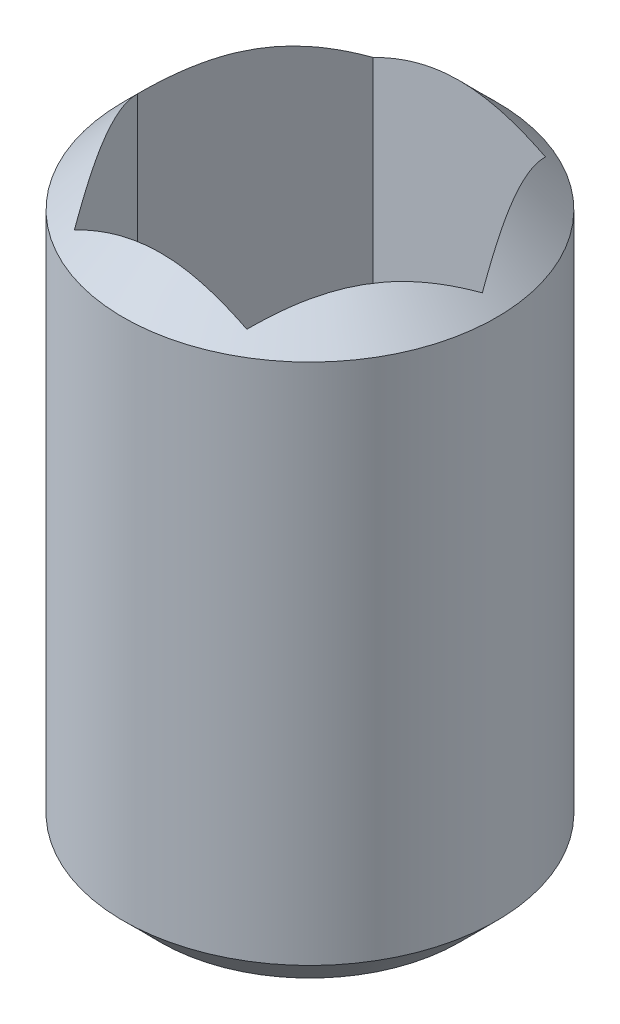
ISO-10303-21;
HEADER;
FILE_DESCRIPTION(('STEP AP214'),'2;1');
FILE_NAME('part.step','',(''),(''),'','','');
FILE_SCHEMA(('AUTOMOTIVE_DESIGN { 1 0 10303 214 1 1 1 1 }'));
ENDSEC;
DATA;
#1=APPLICATION_CONTEXT('core data for automotive mechanical design processes');
#2=APPLICATION_PROTOCOL_DEFINITION('international standard','automotive_design',2000,#1);
#3=PRODUCT_CONTEXT('',#1,'mechanical');
#4=PRODUCT('Part','Part','',(#3));
#5=PRODUCT_RELATED_PRODUCT_CATEGORY('part','',(#4));
#6=PRODUCT_DEFINITION_FORMATION('','',#4);
#7=PRODUCT_DEFINITION_CONTEXT('part definition',#1,'design');
#8=PRODUCT_DEFINITION('design','',#6,#7);
#9=PRODUCT_DEFINITION_SHAPE('','',#8);
#10=(LENGTH_UNIT() NAMED_UNIT(*) SI_UNIT(.MILLI.,.METRE.));
#11=(NAMED_UNIT(*) PLANE_ANGLE_UNIT() SI_UNIT($,.RADIAN.));
#12=(NAMED_UNIT(*) SI_UNIT($,.STERADIAN.) SOLID_ANGLE_UNIT());
#13=UNCERTAINTY_MEASURE_WITH_UNIT(LENGTH_MEASURE(1.E-05),#10,'distance_accuracy_value','');
#14=(GEOMETRIC_REPRESENTATION_CONTEXT(3) GLOBAL_UNCERTAINTY_ASSIGNED_CONTEXT((#13)) GLOBAL_UNIT_ASSIGNED_CONTEXT((#10,
#11,#12)) REPRESENTATION_CONTEXT('',''));
#15=CARTESIAN_POINT('',(0.,0.,0.));
#16=DIRECTION('',(0.,0.,1.));
#17=DIRECTION('',(1.,0.,0.));
#18=AXIS2_PLACEMENT_3D('',#15,#16,#17);
#19=CARTESIAN_POINT('',(3.20604090851,-4.9652643177,179.13));
#20=DIRECTION('',(0.866025403784329,0.,-0.50000000000019));
#21=DIRECTION('',(-0.50000000000019,0.,-0.866025403784329));
#22=AXIS2_PLACEMENT_3D('',#19,#20,#21);
#23=PLANE('',#22);
#24=DIRECTION('',(0.,1.,0.));
#25=VECTOR('',#24,1.);
#26=CARTESIAN_POINT('',(2.628690639321,-4.9652643177,178.13));
#27=LINE('',#26,#25);
#28=CARTESIAN_POINT('',(2.62869063931867,-5.11996485606075,178.129999999997));
#29=VERTEX_POINT('',#28);
#30=CARTESIAN_POINT('',(2.62869063932077,-6.9652643177,178.13));
#31=VERTEX_POINT('',#30);
#32=EDGE_CURVE('E131',#29,#31,#27,.F.);
#33=ORIENTED_EDGE('',*,*,#32,.F.);
#34=CARTESIAN_POINT('',(2.62869063931907,-5.11996485606431,178.129999999993));
#35=CARTESIAN_POINT('',(2.64840481556965,-5.1002690746057,178.164145954892));
#36=CARTESIAN_POINT('',(2.66844651244045,-5.0817233326066,178.198859192143));
#37=CARTESIAN_POINT('',(2.70932116488867,-5.04772861293559,178.269656166926));
#38=CARTESIAN_POINT('',(2.73015837042871,-5.03230025670447,178.305747265609));
#39=CARTESIAN_POINT('',(2.77243501243135,-5.0056588014415,178.378972557531));
#40=CARTESIAN_POINT('',(2.79387214009775,-4.99443143664018,178.416102751817));
#41=CARTESIAN_POINT('',(2.83721633360014,-4.9771464231729,178.491177097176));
#42=CARTESIAN_POINT('',(2.85912172853347,-4.97107278792963,178.529118354161));
#43=CARTESIAN_POINT('',(2.88715008342558,-4.96701549046247,178.577664888887));
#44=CARTESIAN_POINT('',(2.89319019107417,-4.9663595524137,178.588126662217));
#45=CARTESIAN_POINT('',(2.90527517498885,-4.96548388663458,178.609058468366));
#46=CARTESIAN_POINT('',(2.91132004687705,-4.965263921942,178.619528493602));
#47=CARTESIAN_POINT('',(2.93253936049439,-4.96526531090414,178.656281422888));
#48=CARTESIAN_POINT('',(2.94771833376049,-4.96665437945955,178.682572175792));
#49=CARTESIAN_POINT('',(2.97795789257979,-4.97212815747465,178.734948628066));
#50=CARTESIAN_POINT('',(2.99301838814122,-4.97621474707929,178.761034171565));
#51=CARTESIAN_POINT('',(3.03799916042888,-4.99226531814967,178.838943154531));
#52=CARTESIAN_POINT('',(3.06759162055215,-5.00801737945028,178.890198798985));
#53=CARTESIAN_POINT('',(3.11539323529342,-5.04024203951102,178.972993624401));
#54=CARTESIAN_POINT('',(3.13399181732673,-5.05457125741252,179.005207313431));
#55=CARTESIAN_POINT('',(3.17048475474073,-5.08562729588604,179.06841493515));
#56=CARTESIAN_POINT('',(3.18838399540721,-5.10233098798491,179.099417329401));
#57=CARTESIAN_POINT('',(3.20604090851394,-5.11996485606279,179.130000000007));
#58=B_SPLINE_CURVE_WITH_KNOTS('',3,(#34,#35,#36,#37,#38,#39,#40,#41,#42,#43,#44,#45,#46,#47,#48,
#49,#50,#51,#52,#53,#54,#55,#56,#57),.UNSPECIFIED.,.F.,.F.,(4,2,2,2,2,2,2,2,2,2,2,4),(0.,
0.132313199457143,0.265474890466077,0.398180194924322,0.530472334353347,0.566760915531459,
0.603029767558655,0.694057457508987,0.785148659927355,0.968083578352779,1.08759246658368,
1.20600826497133),.UNSPECIFIED.);
#59=CARTESIAN_POINT('',(3.20604090850798,-5.11996485606288,179.130000000004));
#60=VERTEX_POINT('',#59);
#61=EDGE_CURVE('E19',#29,#60,#58,.T.);
#62=ORIENTED_EDGE('',*,*,#61,.T.);
#63=DIRECTION('',(0.,1.,0.));
#64=VECTOR('',#63,1.);
#65=CARTESIAN_POINT('',(3.20604090851,-4.9652643177,179.13));
#66=LINE('',#65,#64);
#67=CARTESIAN_POINT('',(3.20604090851,-6.9652643177,179.13));
#68=VERTEX_POINT('',#67);
#69=EDGE_CURVE('E123',#68,#60,#66,.T.);
#70=ORIENTED_EDGE('',*,*,#69,.F.);
#71=DIRECTION('',(-0.50000000000019,0.,-0.866025403784329));
#72=VECTOR('',#71,1.);
#73=CARTESIAN_POINT('',(3.20604090851,-6.9652643177,179.13));
#74=LINE('',#73,#72);
#75=EDGE_CURVE('E68',#68,#31,#74,.T.);
#76=ORIENTED_EDGE('',*,*,#75,.T.);
#77=EDGE_LOOP('',(#33,#62,#70,#76));
#78=FACE_BOUND('',#77,.T.);
#79=ADVANCED_FACE('F15',(#78),#23,.T.);
#80=CARTESIAN_POINT('',(2.628690639321,-4.9652643177,178.13));
#81=DIRECTION('',(0.866025403784329,0.,0.50000000000019));
#82=DIRECTION('',(0.50000000000019,0.,-0.866025403784329));
#83=AXIS2_PLACEMENT_3D('',#80,#81,#82);
#84=PLANE('',#83);
#85=DIRECTION('',(0.,1.,0.));
#86=VECTOR('',#85,1.);
#87=CARTESIAN_POINT('',(3.20604090851,-4.9652643177,177.13));
#88=LINE('',#87,#86);
#89=CARTESIAN_POINT('',(3.20604090851243,-5.1199648560606,177.129999999997));
#90=VERTEX_POINT('',#89);
#91=CARTESIAN_POINT('',(3.20604090851023,-6.9652643177,177.13));
#92=VERTEX_POINT('',#91);
#93=EDGE_CURVE('E117',#90,#92,#88,.F.);
#94=ORIENTED_EDGE('',*,*,#93,.F.);
#95=CARTESIAN_POINT('',(3.2060409085166,-5.11996485606335,177.129999999995));
#96=CARTESIAN_POINT('',(3.18632673226315,-5.10026907460487,177.164145954892));
#97=CARTESIAN_POINT('',(3.16628503539117,-5.08172333260581,177.198859192143));
#98=CARTESIAN_POINT('',(3.12541038294209,-5.04772861293483,177.269656166926));
#99=CARTESIAN_POINT('',(3.10457317740236,-5.03230025670368,177.305747265609));
#100=CARTESIAN_POINT('',(3.06229653539993,-5.00565880144068,177.37897255753));
#101=CARTESIAN_POINT('',(3.04085940773344,-4.99443143663936,177.416102751817));
#102=CARTESIAN_POINT('',(2.99751521423097,-4.97714642317208,177.491177097176));
#103=CARTESIAN_POINT('',(2.97560981929766,-4.97107278792881,177.529118354161));
#104=CARTESIAN_POINT('',(2.94758146440556,-4.96701549046166,177.577664888886));
#105=CARTESIAN_POINT('',(2.941541356757,-4.9663595524129,177.588126662217));
#106=CARTESIAN_POINT('',(2.92945637284236,-4.96548388663378,177.609058468366));
#107=CARTESIAN_POINT('',(2.92341150095419,-4.9652639219412,177.619528493601));
#108=CARTESIAN_POINT('',(2.90219218733688,-4.96526531090335,177.656281422888));
#109=CARTESIAN_POINT('',(2.88701321407079,-4.96665437945875,177.682572175792));
#110=CARTESIAN_POINT('',(2.85677365525151,-4.97212815747385,177.734948628065));
#111=CARTESIAN_POINT('',(2.8417131596901,-4.97621474707849,177.761034171565));
#112=CARTESIAN_POINT('',(2.79673238740247,-4.99226531814885,177.83894315453));
#113=CARTESIAN_POINT('',(2.76713992727923,-5.00801737944944,177.890198798985));
#114=CARTESIAN_POINT('',(2.71933831253787,-5.04024203951024,177.972993624401));
#115=CARTESIAN_POINT('',(2.70073973050446,-5.05457125741183,178.005207313431));
#116=CARTESIAN_POINT('',(2.66424679309025,-5.08562729588557,178.06841493515));
#117=CARTESIAN_POINT('',(2.64634755242367,-5.10233098798456,178.099417329401));
#118=CARTESIAN_POINT('',(2.62869063931685,-5.11996485606256,178.130000000007));
#119=B_SPLINE_CURVE_WITH_KNOTS('',3,(#95,#96,#97,#98,#99,#100,#101,#102,#103,#104,#105,#106,
#107,#108,#109,#110,#111,#112,#113,#114,#115,#116,#117,#118),.UNSPECIFIED.,.F.,.F.,(4,2,2,2,2,2,
2,2,2,2,2,4),(0.,0.132313199457154,0.265474890466128,0.398180194924439,0.530472334353526,
0.56676091553148,0.603029767558547,0.694057457508813,0.785148659927116,0.968083578352376,
1.08759246658397,1.20600826497229),.UNSPECIFIED.);
#120=EDGE_CURVE('E60',#90,#29,#119,.T.);
#121=ORIENTED_EDGE('',*,*,#120,.T.);
#122=ORIENTED_EDGE('',*,*,#32,.T.);
#123=DIRECTION('',(0.50000000000019,0.,-0.866025403784329));
#124=VECTOR('',#123,1.);
#125=CARTESIAN_POINT('',(2.628690639321,-6.9652643177,178.13));
#126=LINE('',#125,#124);
#127=EDGE_CURVE('E77',#31,#92,#126,.T.);
#128=ORIENTED_EDGE('',*,*,#127,.T.);
#129=EDGE_LOOP('',(#94,#121,#122,#128));
#130=FACE_BOUND('',#129,.T.);
#131=ADVANCED_FACE('F183',(#130),#84,.T.);
#132=CARTESIAN_POINT('',(4.36074144689,-4.9652643177,179.13));
#133=DIRECTION('',(0.,0.,-1.));
#134=DIRECTION('',(-1.,0.,0.));
#135=AXIS2_PLACEMENT_3D('',#132,#133,#134);
#136=PLANE('',#135);
#137=ORIENTED_EDGE('',*,*,#69,.T.);
#138=CARTESIAN_POINT('',(3.2060409085025,-5.119964856064,179.129999999997));
#139=CARTESIAN_POINT('',(3.24546926100682,-5.10026907460543,179.129999999999));
#140=CARTESIAN_POINT('',(3.28555265474972,-5.08172333260633,179.13));
#141=CARTESIAN_POINT('',(3.36730195964712,-5.04772861293529,179.13));
#142=CARTESIAN_POINT('',(3.40897637072687,-5.03230025670414,179.13));
#143=CARTESIAN_POINT('',(3.49352965473196,-5.00565880144111,179.13));
#144=CARTESIAN_POINT('',(3.53640391006488,-4.99443143663977,179.13));
#145=CARTESIAN_POINT('',(3.62309229706976,-4.97714642317246,179.13));
#146=CARTESIAN_POINT('',(3.6669030869364,-4.97107278792919,179.13));
#147=CARTESIAN_POINT('',(3.72295979672066,-4.96701549046202,179.13));
#148=CARTESIAN_POINT('',(3.73504001201782,-4.96635955241325,179.13));
#149=CARTESIAN_POINT('',(3.75920997984718,-4.96548388663413,179.13));
#150=CARTESIAN_POINT('',(3.77129972362356,-4.96526392194155,179.13));
#151=CARTESIAN_POINT('',(3.81373835085822,-4.96526531090369,179.13));
#152=CARTESIAN_POINT('',(3.8440962973904,-4.96665437945909,179.13));
#153=CARTESIAN_POINT('',(3.90457541502893,-4.9721281574742,179.13));
#154=CARTESIAN_POINT('',(3.93469640615176,-4.97621474707884,179.13));
#155=CARTESIAN_POINT('',(4.02465795072701,-4.99226531814921,179.13));
#156=CARTESIAN_POINT('',(4.08384287097348,-5.00801737944981,179.13));
#157=CARTESIAN_POINT('',(4.17944610045607,-5.04024203951057,179.13));
#158=CARTESIAN_POINT('',(4.21664326452278,-5.05457125741212,179.13));
#159=CARTESIAN_POINT('',(4.28962913935097,-5.08562729588575,179.13));
#160=CARTESIAN_POINT('',(4.32542762068401,-5.10233098798468,179.13));
#161=CARTESIAN_POINT('',(4.36074144689756,-5.11996485606264,179.13));
#162=B_SPLINE_CURVE_WITH_KNOTS('',3,(#138,#139,#140,#141,#142,#143,#144,#145,#146,#147,#148,
#149,#150,#151,#152,#153,#154,#155,#156,#157,#158,#159,#160,#161),.UNSPECIFIED.,.F.,.F.,(4,2,2,
2,2,2,2,2,2,2,2,4),(0.,0.132313199457258,0.265474890466312,0.398180194924689,0.530472334353847,
0.566760915531935,0.603029767559114,0.694057457509434,0.785148659927753,0.968083578353058,
1.08759246658432,1.20600826497231),.UNSPECIFIED.);
#163=CARTESIAN_POINT('',(4.36074144689143,-5.11996485606253,179.130000000003));
#164=VERTEX_POINT('',#163);
#165=EDGE_CURVE('E120',#60,#164,#162,.T.);
#166=ORIENTED_EDGE('',*,*,#165,.T.);
#167=DIRECTION('',(0.,1.,0.));
#168=VECTOR('',#167,1.);
#169=CARTESIAN_POINT('',(4.36074144688931,-4.9652643177,179.13));
#170=LINE('',#169,#168);
#171=CARTESIAN_POINT('',(4.36074144688954,-6.9652643177,179.13));
#172=VERTEX_POINT('',#171);
#173=EDGE_CURVE('E96',#172,#164,#170,.T.);
#174=ORIENTED_EDGE('',*,*,#173,.F.);
#175=DIRECTION('',(-1.,0.,0.));
#176=VECTOR('',#175,1.);
#177=CARTESIAN_POINT('',(3.20604090851,-6.9652643177,179.13));
#178=LINE('',#177,#176);
#179=EDGE_CURVE('E81',#68,#172,#178,.F.);
#180=ORIENTED_EDGE('',*,*,#179,.F.);
#181=EDGE_LOOP('',(#137,#166,#174,#180));
#182=FACE_BOUND('',#181,.T.);
#183=ADVANCED_FACE('F170',(#182),#136,.T.);
#184=CARTESIAN_POINT('',(3.20604090851,-4.9652643177,177.13));
#185=DIRECTION('',(0.,0.,1.));
#186=DIRECTION('',(1.,0.,0.));
#187=AXIS2_PLACEMENT_3D('',#184,#185,#186);
#188=PLANE('',#187);
#189=DIRECTION('',(0.,1.,0.));
#190=VECTOR('',#189,1.);
#191=CARTESIAN_POINT('',(4.36074144689,-4.9652643177,177.13));
#192=LINE('',#191,#190);
#193=CARTESIAN_POINT('',(4.36074144689023,-5.11996485605897,177.13));
#194=VERTEX_POINT('',#193);
#195=CARTESIAN_POINT('',(4.36074144689,-6.9652643177,177.13));
#196=VERTEX_POINT('',#195);
#197=EDGE_CURVE('E106',#194,#196,#192,.F.);
#198=ORIENTED_EDGE('',*,*,#197,.F.);
#199=CARTESIAN_POINT('',(4.36074144689045,-5.11996485605908,177.13));
#200=CARTESIAN_POINT('',(4.32131309438616,-5.10026907460161,177.13));
#201=CARTESIAN_POINT('',(4.28122970064349,-5.08172333260318,177.13));
#202=CARTESIAN_POINT('',(4.19948039574674,-5.04772861293308,177.13));
#203=CARTESIAN_POINT('',(4.15780598466741,-5.03230025670218,177.13));
#204=CARTESIAN_POINT('',(4.07325270066315,-5.00565880143973,177.13));
#205=CARTESIAN_POINT('',(4.03037844533063,-4.9944314366387,177.13));
#206=CARTESIAN_POINT('',(3.9436900583266,-4.97714642317191,177.13));
#207=CARTESIAN_POINT('',(3.89987926846041,-4.97107278792884,177.13));
#208=CARTESIAN_POINT('',(3.84382255867706,-4.96701549046189,177.13));
#209=CARTESIAN_POINT('',(3.83174234338035,-4.96635955241316,177.13));
#210=CARTESIAN_POINT('',(3.8075723755519,-4.96548388663411,177.13));
#211=CARTESIAN_POINT('',(3.79548263177598,-4.96526392194155,177.13));
#212=CARTESIAN_POINT('',(3.75304400454178,-4.96526531090369,177.13));
#213=CARTESIAN_POINT('',(3.7226860580096,-4.96665437945909,177.13));
#214=CARTESIAN_POINT('',(3.66220694037107,-4.9721281574742,177.13));
#215=CARTESIAN_POINT('',(3.63208594924824,-4.97621474707884,177.13));
#216=CARTESIAN_POINT('',(3.54212440467299,-4.9922653181492,177.13));
#217=CARTESIAN_POINT('',(3.48293948442652,-5.00801737944981,177.13));
#218=CARTESIAN_POINT('',(3.38733625494391,-5.04024203951058,177.13));
#219=CARTESIAN_POINT('',(3.35013909087718,-5.05457125741213,177.13));
#220=CARTESIAN_POINT('',(3.27715321604895,-5.08562729588579,177.13));
#221=CARTESIAN_POINT('',(3.24135473471589,-5.10233098798473,177.13));
#222=CARTESIAN_POINT('',(3.20604090850232,-5.11996485606269,177.13));
#223=B_SPLINE_CURVE_WITH_KNOTS('',3,(#199,#200,#201,#202,#203,#204,#205,#206,#207,#208,#209,
#210,#211,#212,#213,#214,#215,#216,#217,#218,#219,#220,#221,#222),.UNSPECIFIED.,.F.,.F.,(4,2,2,
2,2,2,2,2,2,2,2,4),(0.,0.132313199455793,0.265474890463401,0.398180194920376,0.53047233434813,
0.566760915524849,0.603029767550657,0.694057457500975,0.785148659919294,0.968083578344601,
1.08759246657593,1.20600826496399),.UNSPECIFIED.);
#224=EDGE_CURVE('E119',#194,#90,#223,.T.);
#225=ORIENTED_EDGE('',*,*,#224,.T.);
#226=ORIENTED_EDGE('',*,*,#93,.T.);
#227=DIRECTION('',(-1.,0.,0.));
#228=VECTOR('',#227,1.);
#229=CARTESIAN_POINT('',(3.20604090851,-6.9652643177,177.13));
#230=LINE('',#229,#228);
#231=EDGE_CURVE('E97',#196,#92,#230,.T.);
#232=ORIENTED_EDGE('',*,*,#231,.F.);
#233=EDGE_LOOP('',(#198,#225,#226,#232));
#234=FACE_BOUND('',#233,.T.);
#235=ADVANCED_FACE('F166',(#234),#188,.T.);
#236=CARTESIAN_POINT('',(3.20604090851,-6.9652643177,179.13));
#237=DIRECTION('',(0.,1.,0.));
#238=DIRECTION('',(-1.,0.,0.));
#239=AXIS2_PLACEMENT_3D('',#236,#237,#238);
#240=PLANE('',#239);
#241=ORIENTED_EDGE('',*,*,#127,.F.);
#242=ORIENTED_EDGE('',*,*,#75,.F.);
#243=ORIENTED_EDGE('',*,*,#179,.T.);
#244=DIRECTION('',(-0.50000000000019,0.,0.866025403784329));
#245=VECTOR('',#244,1.);
#246=CARTESIAN_POINT('',(4.938091716079,-6.9652643177,178.13));
#247=LINE('',#246,#245);
#248=CARTESIAN_POINT('',(4.93809171607958,-6.9652643177,178.13));
#249=VERTEX_POINT('',#248);
#250=EDGE_CURVE('E88',#249,#172,#247,.T.);
#251=ORIENTED_EDGE('',*,*,#250,.F.);
#252=DIRECTION('',(0.50000000000019,0.,0.866025403784329));
#253=VECTOR('',#252,1.);
#254=CARTESIAN_POINT('',(4.36074144689,-6.9652643177,177.13));
#255=LINE('',#254,#253);
#256=EDGE_CURVE('E93',#196,#249,#255,.T.);
#257=ORIENTED_EDGE('',*,*,#256,.F.);
#258=ORIENTED_EDGE('',*,*,#231,.T.);
#259=EDGE_LOOP('',(#241,#242,#243,#251,#257,#258));
#260=FACE_BOUND('',#259,.T.);
#261=ADVANCED_FACE('F90',(#260),#240,.T.);
#262=CARTESIAN_POINT('',(4.938091716079,-4.9652643177,178.13));
#263=DIRECTION('',(-0.866025403784329,0.,-0.50000000000019));
#264=DIRECTION('',(-0.50000000000019,0.,0.866025403784329));
#265=AXIS2_PLACEMENT_3D('',#262,#263,#264);
#266=PLANE('',#265);
#267=ORIENTED_EDGE('',*,*,#173,.T.);
#268=CARTESIAN_POINT('',(4.3607414468833,-5.11996485606341,179.130000000005));
#269=CARTESIAN_POINT('',(4.38045562314031,-5.10026907460139,179.095854045102));
#270=CARTESIAN_POINT('',(4.40049732001596,-5.08172333259921,179.061140807845));
#271=CARTESIAN_POINT('',(4.4413719724726,-5.04772861292329,178.990343833049));
#272=CARTESIAN_POINT('',(4.46220917801622,-5.03230025669034,178.954252734359));
#273=CARTESIAN_POINT('',(4.5044858200191,-5.00565880143032,178.881027442437));
#274=CARTESIAN_POINT('',(4.52592294768191,-4.99443143663229,178.843897248156));
#275=CARTESIAN_POINT('',(4.5692671411768,-4.97714642316991,178.76882290281));
#276=CARTESIAN_POINT('',(4.59117253610621,-4.97107278792826,178.730881645833));
#277=CARTESIAN_POINT('',(4.61920089099415,-4.9670154904617,178.682335111114));
#278=CARTESIAN_POINT('',(4.62524099864247,-4.96635955241295,178.671873337784));
#279=CARTESIAN_POINT('',(4.63732598255712,-4.9654838866338,178.650941531635));
#280=CARTESIAN_POINT('',(4.64337085444554,-4.9652639219412,178.640471506399));
#281=CARTESIAN_POINT('',(4.6645901680659,-4.96526531090334,178.603718577107));
#282=CARTESIAN_POINT('',(4.67976914133481,-4.96665437945924,178.577427824199));
#283=CARTESIAN_POINT('',(4.71000870015959,-4.97212815747637,178.525051371916));
#284=CARTESIAN_POINT('',(4.72506919572369,-4.97621474708256,178.498965828412));
#285=CARTESIAN_POINT('',(4.7700499680087,-4.99226531815452,178.42105684545));
#286=CARTESIAN_POINT('',(4.79964242812742,-5.0080173794524,178.369801201004));
#287=CARTESIAN_POINT('',(4.84744404075837,-5.04024203809302,178.287006379243));
#288=CARTESIAN_POINT('',(4.86604262075158,-5.05457125422255,178.254792693746));
#289=CARTESIAN_POINT('',(4.9025355542378,-5.08562728868715,178.191585078831));
#290=CARTESIAN_POINT('',(4.92043479301502,-5.10233097855609,178.160582687852));
#291=CARTESIAN_POINT('',(4.93809170428377,-5.11996484426318,178.13000002043));
#292=B_SPLINE_CURVE_WITH_KNOTS('',3,(#268,#269,#270,#271,#272,#273,#274,#275,#276,#277,#278,
#279,#280,#281,#282,#283,#284,#285,#286,#287,#288,#289,#290,#291),.UNSPECIFIED.,.F.,.F.,(4,2,2,
2,2,2,2,2,2,2,2,4),(0.,0.132313199480797,0.265474890513454,0.398180194947982,0.530472334353484,
0.566760915529966,0.603029767558569,0.694057457525581,0.785148659960898,0.968083578352466,
1.08759245327908,1.20600823860219),.UNSPECIFIED.);
#293=CARTESIAN_POINT('',(4.93809170428402,-5.11996484426343,178.13));
#294=VERTEX_POINT('',#293);
#295=EDGE_CURVE('E102',#164,#294,#292,.T.);
#296=ORIENTED_EDGE('',*,*,#295,.T.);
#297=DIRECTION('',(0.,1.,0.));
#298=VECTOR('',#297,1.);
#299=CARTESIAN_POINT('',(4.93809171607969,-4.9652643177,178.13));
#300=LINE('',#299,#298);
#301=EDGE_CURVE('E99',#249,#294,#300,.T.);
#302=ORIENTED_EDGE('',*,*,#301,.F.);
#303=ORIENTED_EDGE('',*,*,#250,.T.);
#304=EDGE_LOOP('',(#267,#296,#302,#303));
#305=FACE_BOUND('',#304,.T.);
#306=ADVANCED_FACE('F100',(#305),#266,.T.);
#307=CARTESIAN_POINT('',(4.36074144689,-4.9652643177,177.13));
#308=DIRECTION('',(-0.866025403784329,0.,0.50000000000019));
#309=DIRECTION('',(0.50000000000019,0.,0.866025403784329));
#310=AXIS2_PLACEMENT_3D('',#307,#308,#309);
#311=PLANE('',#310);
#312=ORIENTED_EDGE('',*,*,#301,.T.);
#313=CARTESIAN_POINT('',(4.36074144688977,-5.11996485605908,177.13));
#314=CARTESIAN_POINT('',(4.38045562314541,-5.10026907459816,177.164145954904));
#315=CARTESIAN_POINT('',(4.40049732002038,-5.08172333259666,177.198859192161));
#316=CARTESIAN_POINT('',(4.44137197247626,-5.04772861292172,177.269656166956));
#317=CARTESIAN_POINT('',(4.4622091780198,-5.03230025668906,177.305747265645));
#318=CARTESIAN_POINT('',(4.50448582002236,-5.00565880142966,177.378972557567));
#319=CARTESIAN_POINT('',(4.52592294768492,-4.99443143663197,177.416102751847));
#320=CARTESIAN_POINT('',(4.56926714117932,-4.97714642317014,177.491177097192));
#321=CARTESIAN_POINT('',(4.59117253610849,-4.9710727879287,177.52911835417));
#322=CARTESIAN_POINT('',(4.61920089099597,-4.96701549046237,177.577664888887));
#323=CARTESIAN_POINT('',(4.62524099864406,-4.96635955241366,177.588126662217));
#324=CARTESIAN_POINT('',(4.63732598255827,-4.96548388663458,177.609058468365));
#325=CARTESIAN_POINT('',(4.64337085444648,-4.96526392194199,177.619528493601));
#326=CARTESIAN_POINT('',(4.66459016806662,-4.96526531090414,177.656281422893));
#327=CARTESIAN_POINT('',(4.67976914133554,-4.96665437946004,177.682572175801));
#328=CARTESIAN_POINT('',(4.71000870016034,-4.97212815747718,177.734948628084));
#329=CARTESIAN_POINT('',(4.72506919572446,-4.97621474708337,177.761034171588));
#330=CARTESIAN_POINT('',(4.77004996800951,-4.99226531815535,177.838943154549));
#331=CARTESIAN_POINT('',(4.79964242812825,-5.00801737945325,177.890198798996));
#332=CARTESIAN_POINT('',(4.84744404075916,-5.04024203809384,177.972993620757));
#333=CARTESIAN_POINT('',(4.8660426207523,-5.05457125422332,178.005207306253));
#334=CARTESIAN_POINT('',(4.9025355542384,-5.08562728868779,178.068414921168));
#335=CARTESIAN_POINT('',(4.92043479301556,-5.10233097855665,178.099417312147));
#336=CARTESIAN_POINT('',(4.93809170428425,-5.11996484426367,178.129999979569));
#337=B_SPLINE_CURVE_WITH_KNOTS('',3,(#313,#314,#315,#316,#317,#318,#319,#320,#321,#322,#323,
#324,#325,#326,#327,#328,#329,#330,#331,#332,#333,#334,#335,#336),.UNSPECIFIED.,.F.,.F.,(4,2,2,
2,2,2,2,2,2,2,2,4),(0.,0.13231319947922,0.265474890510357,0.398180194943384,0.530472334347369,
0.566760915522501,0.60302976754979,0.694057457516835,0.785148659952278,0.96808357834398,
1.08759245327018,1.20600823859287),.UNSPECIFIED.);
#338=EDGE_CURVE('E38',#194,#294,#337,.T.);
#339=ORIENTED_EDGE('',*,*,#338,.F.);
#340=ORIENTED_EDGE('',*,*,#197,.T.);
#341=ORIENTED_EDGE('',*,*,#256,.T.);
#342=EDGE_LOOP('',(#312,#339,#340,#341));
#343=FACE_BOUND('',#342,.T.);
#344=ADVANCED_FACE('F104',(#343),#311,.T.);
#345=CARTESIAN_POINT('',(3.7833911777,-8.9652643177,178.13));
#346=DIRECTION('',(0.,1.,0.));
#347=DIRECTION('',(-1.,0.,0.));
#348=AXIS2_PLACEMENT_3D('',#345,#346,#347);
#349=PLANE('',#348);
#350=CARTESIAN_POINT('',(3.7833911777,-8.96526431762368,178.13));
#351=DIRECTION('',(0.,1.,0.));
#352=DIRECTION('',(-1.,0.,0.));
#353=AXIS2_PLACEMENT_3D('',#350,#351,#352);
#354=CIRCLE('',#353,1.00000000009569);
#355=CARTESIAN_POINT('',(2.78339117760431,-8.96526431762368,178.13));
#356=VERTEX_POINT('',#355);
#357=EDGE_CURVE('E141',#356,#356,#354,.T.);
#358=ORIENTED_EDGE('',*,*,#357,.F.);
#359=EDGE_LOOP('',(#358));
#360=FACE_BOUND('',#359,.T.);
#361=ADVANCED_FACE('F160',(#360),#349,.F.);
#362=CARTESIAN_POINT('',(3.7833911777,-5.21526431759867,178.13));
#363=DIRECTION('',(0.,-1.,0.));
#364=DIRECTION('',(1.,0.,0.));
#365=AXIS2_PLACEMENT_3D('',#362,#363,#364);
#366=CONICAL_SURFACE('',#365,1.24999999991925,0.785398163397447);
#367=ORIENTED_EDGE('',*,*,#338,.T.);
#368=ORIENTED_EDGE('',*,*,#295,.F.);
#369=ORIENTED_EDGE('',*,*,#165,.F.);
#370=ORIENTED_EDGE('',*,*,#61,.F.);
#371=ORIENTED_EDGE('',*,*,#120,.F.);
#372=ORIENTED_EDGE('',*,*,#224,.F.);
#373=EDGE_LOOP('',(#367,#368,#369,#370,#371,#372));
#374=FACE_BOUND('',#373,.T.);
#375=CARTESIAN_POINT('',(3.7833911777,-5.2152643177,178.13));
#376=DIRECTION('',(0.,1.,0.));
#377=DIRECTION('',(-1.,0.,0.));
#378=AXIS2_PLACEMENT_3D('',#375,#376,#377);
#379=CIRCLE('',#378,1.25);
#380=CARTESIAN_POINT('',(2.5333911777,-5.2152643177,178.13));
#381=VERTEX_POINT('',#380);
#382=EDGE_CURVE('E29',#381,#381,#379,.F.);
#383=ORIENTED_EDGE('',*,*,#382,.F.);
#384=EDGE_LOOP('',(#383));
#385=FACE_BOUND('',#384,.T.);
#386=ADVANCED_FACE('F154',(#374,#385),#366,.T.);
#387=CARTESIAN_POINT('',(3.7833911777,-8.71526431768643,178.13));
#388=DIRECTION('',(0.,1.,0.));
#389=DIRECTION('',(-1.,0.,0.));
#390=AXIS2_PLACEMENT_3D('',#387,#388,#389);
#391=CONICAL_SURFACE('',#390,1.25000000003294,0.785398163397448);
#392=CARTESIAN_POINT('',(3.7833911777,-8.7152643177,178.13));
#393=DIRECTION('',(0.,1.,0.));
#394=DIRECTION('',(-1.,0.,0.));
#395=AXIS2_PLACEMENT_3D('',#392,#393,#394);
#396=CIRCLE('',#395,1.25);
#397=CARTESIAN_POINT('',(2.5333911777,-8.7152643177,178.13));
#398=VERTEX_POINT('',#397);
#399=EDGE_CURVE('E10',#398,#398,#396,.T.);
#400=ORIENTED_EDGE('',*,*,#399,.F.);
#401=EDGE_LOOP('',(#400));
#402=FACE_BOUND('',#401,.T.);
#403=ORIENTED_EDGE('',*,*,#357,.T.);
#404=EDGE_LOOP('',(#403));
#405=FACE_BOUND('',#404,.T.);
#406=ADVANCED_FACE('F194',(#402,#405),#391,.T.);
#407=CARTESIAN_POINT('',(3.7833911777,-8.9652643177,178.13));
#408=DIRECTION('',(0.,1.,0.));
#409=DIRECTION('',(-1.,0.,0.));
#410=AXIS2_PLACEMENT_3D('',#407,#408,#409);
#411=CYLINDRICAL_SURFACE('',#410,1.25);
#412=ORIENTED_EDGE('',*,*,#382,.T.);
#413=EDGE_LOOP('',(#412));
#414=FACE_BOUND('',#413,.T.);
#415=ORIENTED_EDGE('',*,*,#399,.T.);
#416=EDGE_LOOP('',(#415));
#417=FACE_BOUND('',#416,.T.);
#418=ADVANCED_FACE('F192',(#414,#417),#411,.T.);
#419=CLOSED_SHELL('',(#79,#131,#183,#235,#261,#306,#344,#361,#386,#406,#418));
#420=MANIFOLD_SOLID_BREP('B1',#419);
#421=ADVANCED_BREP_SHAPE_REPRESENTATION('',(#18,#420),#14);
#422=SHAPE_DEFINITION_REPRESENTATION(#9,#421);
ENDSEC;
END-ISO-10303-21;
